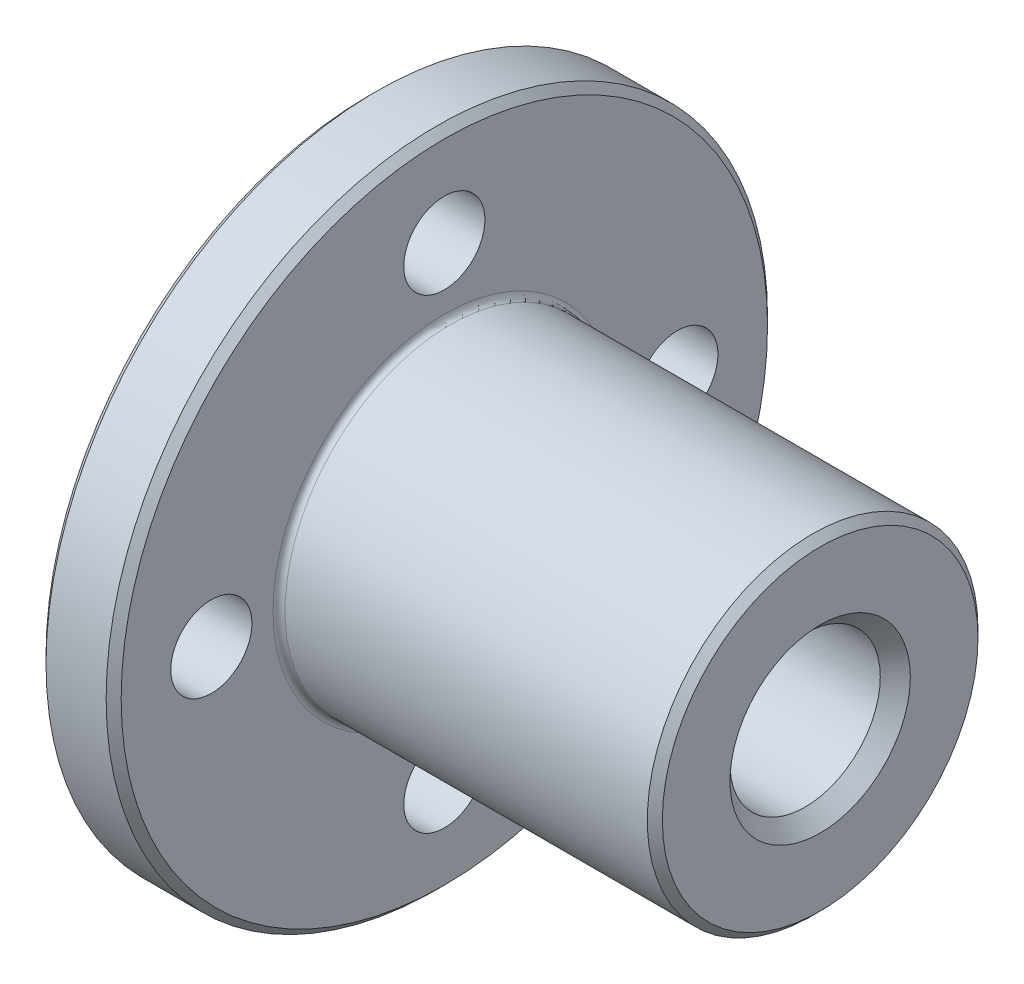
ISO-10303-21;
HEADER;
FILE_DESCRIPTION(('STEP AP214'),'2;1');
FILE_NAME('part.step','',(''),(''),'','','');
FILE_SCHEMA(('AUTOMOTIVE_DESIGN { 1 0 10303 214 1 1 1 1 }'));
ENDSEC;
DATA;
#1=APPLICATION_CONTEXT('core data for automotive mechanical design processes');
#2=APPLICATION_PROTOCOL_DEFINITION('international standard','automotive_design',2000,#1);
#3=PRODUCT_CONTEXT('',#1,'mechanical');
#4=PRODUCT('Part','Part','',(#3));
#5=PRODUCT_RELATED_PRODUCT_CATEGORY('part','',(#4));
#6=PRODUCT_DEFINITION_FORMATION('','',#4);
#7=PRODUCT_DEFINITION_CONTEXT('part definition',#1,'design');
#8=PRODUCT_DEFINITION('design','',#6,#7);
#9=PRODUCT_DEFINITION_SHAPE('','',#8);
#10=(LENGTH_UNIT() NAMED_UNIT(*) SI_UNIT(.MILLI.,.METRE.));
#11=(NAMED_UNIT(*) PLANE_ANGLE_UNIT() SI_UNIT($,.RADIAN.));
#12=(NAMED_UNIT(*) SI_UNIT($,.STERADIAN.) SOLID_ANGLE_UNIT());
#13=UNCERTAINTY_MEASURE_WITH_UNIT(LENGTH_MEASURE(1.E-05),#10,'distance_accuracy_value','');
#14=(GEOMETRIC_REPRESENTATION_CONTEXT(3) GLOBAL_UNCERTAINTY_ASSIGNED_CONTEXT((#13)) GLOBAL_UNIT_ASSIGNED_CONTEXT((#10,
#11,#12)) REPRESENTATION_CONTEXT('',''));
#15=CARTESIAN_POINT('',(0.,0.,0.));
#16=DIRECTION('',(0.,0.,1.));
#17=DIRECTION('',(1.,0.,0.));
#18=AXIS2_PLACEMENT_3D('',#15,#16,#17);
#19=CARTESIAN_POINT('',(5.,0.,0.));
#20=DIRECTION('',(-1.,0.,0.));
#21=DIRECTION('',(0.,0.,1.));
#22=AXIS2_PLACEMENT_3D('',#19,#20,#21);
#23=CYLINDRICAL_SURFACE('',#22,22.);
#24=CARTESIAN_POINT('',(0.500000000000025,0.,0.));
#25=DIRECTION('',(-1.,0.,0.));
#26=DIRECTION('',(0.,0.,1.));
#27=AXIS2_PLACEMENT_3D('',#24,#25,#26);
#28=CIRCLE('',#27,22.);
#29=CARTESIAN_POINT('',(0.500000000000025,0.,22.));
#30=VERTEX_POINT('',#29);
#31=EDGE_CURVE('E67',#30,#30,#28,.F.);
#32=ORIENTED_EDGE('',*,*,#31,.T.);
#33=EDGE_LOOP('',(#32));
#34=FACE_BOUND('',#33,.T.);
#35=CARTESIAN_POINT('',(4.49999999999999,0.,0.));
#36=DIRECTION('',(1.,0.,0.));
#37=DIRECTION('',(0.,0.,-1.));
#38=AXIS2_PLACEMENT_3D('',#35,#36,#37);
#39=CIRCLE('',#38,22.);
#40=CARTESIAN_POINT('',(4.49999999999999,0.,-22.));
#41=VERTEX_POINT('',#40);
#42=EDGE_CURVE('E70',#41,#41,#39,.F.);
#43=ORIENTED_EDGE('',*,*,#42,.T.);
#44=EDGE_LOOP('',(#43));
#45=FACE_BOUND('',#44,.T.);
#46=ADVANCED_FACE('F32',(#34,#45),#23,.T.);
#47=CARTESIAN_POINT('',(5.,22.,0.));
#48=DIRECTION('',(1.,0.,0.));
#49=DIRECTION('',(0.,0.,-1.));
#50=AXIS2_PLACEMENT_3D('',#47,#48,#49);
#51=PLANE('',#50);
#52=CARTESIAN_POINT('',(5.,0.,0.));
#53=DIRECTION('',(1.,0.,0.));
#54=DIRECTION('',(0.,0.,-1.));
#55=AXIS2_PLACEMENT_3D('',#52,#53,#54);
#56=CIRCLE('',#55,11.4);
#57=CARTESIAN_POINT('',(5.,0.,-11.4));
#58=VERTEX_POINT('',#57);
#59=EDGE_CURVE('E10',#58,#58,#56,.F.);
#60=ORIENTED_EDGE('',*,*,#59,.T.);
#61=EDGE_LOOP('',(#60));
#62=FACE_BOUND('',#61,.T.);
#63=CARTESIAN_POINT('',(5.,0.,0.));
#64=DIRECTION('',(1.,0.,0.));
#65=DIRECTION('',(0.,0.,-1.));
#66=AXIS2_PLACEMENT_3D('',#63,#64,#65);
#67=CIRCLE('',#66,21.5);
#68=CARTESIAN_POINT('',(5.,0.,-21.5));
#69=VERTEX_POINT('',#68);
#70=EDGE_CURVE('E58',#69,#69,#67,.T.);
#71=ORIENTED_EDGE('',*,*,#70,.T.);
#72=EDGE_LOOP('',(#71));
#73=FACE_BOUND('',#72,.T.);
#74=CARTESIAN_POINT('',(5.,-15.5,0.));
#75=DIRECTION('',(1.,0.,0.));
#76=DIRECTION('',(0.,0.,-1.));
#77=AXIS2_PLACEMENT_3D('',#74,#75,#76);
#78=CIRCLE('',#77,2.69999999999999);
#79=CARTESIAN_POINT('',(5.,-15.5,-2.69999999999999));
#80=VERTEX_POINT('',#79);
#81=EDGE_CURVE('E97',#80,#80,#78,.T.);
#82=ORIENTED_EDGE('',*,*,#81,.F.);
#83=EDGE_LOOP('',(#82));
#84=FACE_BOUND('',#83,.T.);
#85=CARTESIAN_POINT('',(5.,0.,-15.5));
#86=DIRECTION('',(1.,0.,0.));
#87=DIRECTION('',(0.,0.,-1.));
#88=AXIS2_PLACEMENT_3D('',#85,#86,#87);
#89=CIRCLE('',#88,2.69999999999999);
#90=CARTESIAN_POINT('',(5.,0.,-18.2));
#91=VERTEX_POINT('',#90);
#92=EDGE_CURVE('E91',#91,#91,#89,.T.);
#93=ORIENTED_EDGE('',*,*,#92,.F.);
#94=EDGE_LOOP('',(#93));
#95=FACE_BOUND('',#94,.T.);
#96=CARTESIAN_POINT('',(5.,0.,15.5));
#97=DIRECTION('',(1.,0.,0.));
#98=DIRECTION('',(0.,0.,-1.));
#99=AXIS2_PLACEMENT_3D('',#96,#97,#98);
#100=CIRCLE('',#99,2.69999999999999);
#101=CARTESIAN_POINT('',(5.,0.,12.8));
#102=VERTEX_POINT('',#101);
#103=EDGE_CURVE('E85',#102,#102,#100,.T.);
#104=ORIENTED_EDGE('',*,*,#103,.F.);
#105=EDGE_LOOP('',(#104));
#106=FACE_BOUND('',#105,.T.);
#107=CARTESIAN_POINT('',(5.,15.5,0.));
#108=DIRECTION('',(1.,0.,0.));
#109=DIRECTION('',(0.,0.,-1.));
#110=AXIS2_PLACEMENT_3D('',#107,#108,#109);
#111=CIRCLE('',#110,2.69999999999999);
#112=CARTESIAN_POINT('',(5.,15.5,-2.69999999999999));
#113=VERTEX_POINT('',#112);
#114=EDGE_CURVE('E79',#113,#113,#111,.T.);
#115=ORIENTED_EDGE('',*,*,#114,.F.);
#116=EDGE_LOOP('',(#115));
#117=FACE_BOUND('',#116,.T.);
#118=ADVANCED_FACE('F103',(#62,#73,#84,#95,#106,#117),#51,.T.);
#119=CARTESIAN_POINT('',(0.,0.,0.));
#120=DIRECTION('',(-1.,0.,0.));
#121=DIRECTION('',(0.,0.,1.));
#122=AXIS2_PLACEMENT_3D('',#119,#120,#121);
#123=PLANE('',#122);
#124=CARTESIAN_POINT('',(0.,0.,0.));
#125=DIRECTION('',(-1.,0.,0.));
#126=DIRECTION('',(0.,0.,1.));
#127=AXIS2_PLACEMENT_3D('',#124,#125,#126);
#128=CIRCLE('',#127,5.99999999999997);
#129=CARTESIAN_POINT('',(0.,0.,5.99999999999997));
#130=VERTEX_POINT('',#129);
#131=EDGE_CURVE('E55',#130,#130,#128,.F.);
#132=ORIENTED_EDGE('',*,*,#131,.T.);
#133=EDGE_LOOP('',(#132));
#134=FACE_BOUND('',#133,.T.);
#135=CARTESIAN_POINT('',(0.,0.,0.));
#136=DIRECTION('',(-1.,0.,0.));
#137=DIRECTION('',(0.,0.,1.));
#138=AXIS2_PLACEMENT_3D('',#135,#136,#137);
#139=CIRCLE('',#138,21.5);
#140=CARTESIAN_POINT('',(0.,0.,21.5));
#141=VERTEX_POINT('',#140);
#142=EDGE_CURVE('E73',#141,#141,#139,.T.);
#143=ORIENTED_EDGE('',*,*,#142,.T.);
#144=EDGE_LOOP('',(#143));
#145=FACE_BOUND('',#144,.T.);
#146=CARTESIAN_POINT('',(0.,-15.5,0.));
#147=DIRECTION('',(1.,0.,0.));
#148=DIRECTION('',(0.,0.,-1.));
#149=AXIS2_PLACEMENT_3D('',#146,#147,#148);
#150=CIRCLE('',#149,2.69999999999999);
#151=CARTESIAN_POINT('',(0.,-15.5,-2.69999999999999));
#152=VERTEX_POINT('',#151);
#153=EDGE_CURVE('E94',#152,#152,#150,.T.);
#154=ORIENTED_EDGE('',*,*,#153,.T.);
#155=EDGE_LOOP('',(#154));
#156=FACE_BOUND('',#155,.T.);
#157=CARTESIAN_POINT('',(0.,0.,-15.5));
#158=DIRECTION('',(1.,0.,0.));
#159=DIRECTION('',(0.,0.,-1.));
#160=AXIS2_PLACEMENT_3D('',#157,#158,#159);
#161=CIRCLE('',#160,2.69999999999999);
#162=CARTESIAN_POINT('',(0.,0.,-18.2));
#163=VERTEX_POINT('',#162);
#164=EDGE_CURVE('E88',#163,#163,#161,.T.);
#165=ORIENTED_EDGE('',*,*,#164,.T.);
#166=EDGE_LOOP('',(#165));
#167=FACE_BOUND('',#166,.T.);
#168=CARTESIAN_POINT('',(0.,0.,15.5));
#169=DIRECTION('',(1.,0.,0.));
#170=DIRECTION('',(0.,0.,-1.));
#171=AXIS2_PLACEMENT_3D('',#168,#169,#170);
#172=CIRCLE('',#171,2.69999999999999);
#173=CARTESIAN_POINT('',(0.,0.,12.8));
#174=VERTEX_POINT('',#173);
#175=EDGE_CURVE('E82',#174,#174,#172,.T.);
#176=ORIENTED_EDGE('',*,*,#175,.T.);
#177=EDGE_LOOP('',(#176));
#178=FACE_BOUND('',#177,.T.);
#179=CARTESIAN_POINT('',(0.,15.5,0.));
#180=DIRECTION('',(1.,0.,0.));
#181=DIRECTION('',(0.,0.,-1.));
#182=AXIS2_PLACEMENT_3D('',#179,#180,#181);
#183=CIRCLE('',#182,2.69999999999999);
#184=CARTESIAN_POINT('',(0.,15.5,-2.69999999999999));
#185=VERTEX_POINT('',#184);
#186=EDGE_CURVE('E76',#185,#185,#183,.T.);
#187=ORIENTED_EDGE('',*,*,#186,.T.);
#188=EDGE_LOOP('',(#187));
#189=FACE_BOUND('',#188,.T.);
#190=ADVANCED_FACE('F106',(#134,#145,#156,#167,#178,#189),#123,.T.);
#191=CARTESIAN_POINT('',(30.,0.,0.));
#192=DIRECTION('',(-1.,0.,0.));
#193=DIRECTION('',(0.,0.,1.));
#194=AXIS2_PLACEMENT_3D('',#191,#192,#193);
#195=CYLINDRICAL_SURFACE('',#194,11.);
#196=CARTESIAN_POINT('',(5.4,0.,0.));
#197=DIRECTION('',(1.,0.,0.));
#198=DIRECTION('',(0.,0.,-1.));
#199=AXIS2_PLACEMENT_3D('',#196,#197,#198);
#200=CIRCLE('',#199,11.);
#201=CARTESIAN_POINT('',(5.4,0.,-11.));
#202=VERTEX_POINT('',#201);
#203=EDGE_CURVE('E39',#202,#202,#200,.T.);
#204=ORIENTED_EDGE('',*,*,#203,.T.);
#205=EDGE_LOOP('',(#204));
#206=FACE_BOUND('',#205,.T.);
#207=CARTESIAN_POINT('',(29.5,0.,0.));
#208=DIRECTION('',(1.,0.,0.));
#209=DIRECTION('',(0.,0.,-1.));
#210=AXIS2_PLACEMENT_3D('',#207,#208,#209);
#211=CIRCLE('',#210,11.);
#212=CARTESIAN_POINT('',(29.5,0.,-11.));
#213=VERTEX_POINT('',#212);
#214=EDGE_CURVE('E61',#213,#213,#211,.F.);
#215=ORIENTED_EDGE('',*,*,#214,.T.);
#216=EDGE_LOOP('',(#215));
#217=FACE_BOUND('',#216,.T.);
#218=ADVANCED_FACE('F127',(#206,#217),#195,.T.);
#219=CARTESIAN_POINT('',(30.,0.,0.));
#220=DIRECTION('',(1.,0.,0.));
#221=DIRECTION('',(0.,0.,-1.));
#222=AXIS2_PLACEMENT_3D('',#219,#220,#221);
#223=PLANE('',#222);
#224=CARTESIAN_POINT('',(30.,0.,0.));
#225=DIRECTION('',(1.,0.,0.));
#226=DIRECTION('',(0.,0.,-1.));
#227=AXIS2_PLACEMENT_3D('',#224,#225,#226);
#228=CIRCLE('',#227,5.99999999999995);
#229=CARTESIAN_POINT('',(30.,0.,-5.99999999999995));
#230=VERTEX_POINT('',#229);
#231=EDGE_CURVE('E43',#230,#230,#228,.F.);
#232=ORIENTED_EDGE('',*,*,#231,.T.);
#233=EDGE_LOOP('',(#232));
#234=FACE_BOUND('',#233,.T.);
#235=CARTESIAN_POINT('',(30.,0.,0.));
#236=DIRECTION('',(1.,0.,0.));
#237=DIRECTION('',(0.,0.,-1.));
#238=AXIS2_PLACEMENT_3D('',#235,#236,#237);
#239=CIRCLE('',#238,10.5);
#240=CARTESIAN_POINT('',(30.,0.,-10.5));
#241=VERTEX_POINT('',#240);
#242=EDGE_CURVE('E64',#241,#241,#239,.T.);
#243=ORIENTED_EDGE('',*,*,#242,.T.);
#244=EDGE_LOOP('',(#243));
#245=FACE_BOUND('',#244,.T.);
#246=ADVANCED_FACE('F117',(#234,#245),#223,.T.);
#247=CARTESIAN_POINT('',(5.,15.5,0.));
#248=DIRECTION('',(1.,0.,0.));
#249=DIRECTION('',(0.,0.,-1.));
#250=AXIS2_PLACEMENT_3D('',#247,#248,#249);
#251=CYLINDRICAL_SURFACE('',#250,2.69999999999999);
#252=ORIENTED_EDGE('',*,*,#186,.F.);
#253=EDGE_LOOP('',(#252));
#254=FACE_BOUND('',#253,.T.);
#255=ORIENTED_EDGE('',*,*,#114,.T.);
#256=EDGE_LOOP('',(#255));
#257=FACE_BOUND('',#256,.T.);
#258=ADVANCED_FACE('F114',(#254,#257),#251,.F.);
#259=CARTESIAN_POINT('',(5.,0.,15.5));
#260=DIRECTION('',(1.,0.,0.));
#261=DIRECTION('',(0.,0.,-1.));
#262=AXIS2_PLACEMENT_3D('',#259,#260,#261);
#263=CYLINDRICAL_SURFACE('',#262,2.69999999999999);
#264=ORIENTED_EDGE('',*,*,#175,.F.);
#265=EDGE_LOOP('',(#264));
#266=FACE_BOUND('',#265,.T.);
#267=ORIENTED_EDGE('',*,*,#103,.T.);
#268=EDGE_LOOP('',(#267));
#269=FACE_BOUND('',#268,.T.);
#270=ADVANCED_FACE('F116',(#266,#269),#263,.F.);
#271=CARTESIAN_POINT('',(5.,0.,-15.5));
#272=DIRECTION('',(1.,0.,0.));
#273=DIRECTION('',(0.,0.,-1.));
#274=AXIS2_PLACEMENT_3D('',#271,#272,#273);
#275=CYLINDRICAL_SURFACE('',#274,2.69999999999999);
#276=ORIENTED_EDGE('',*,*,#164,.F.);
#277=EDGE_LOOP('',(#276));
#278=FACE_BOUND('',#277,.T.);
#279=ORIENTED_EDGE('',*,*,#92,.T.);
#280=EDGE_LOOP('',(#279));
#281=FACE_BOUND('',#280,.T.);
#282=ADVANCED_FACE('F124',(#278,#281),#275,.F.);
#283=CARTESIAN_POINT('',(5.,-15.5,0.));
#284=DIRECTION('',(1.,0.,0.));
#285=DIRECTION('',(0.,0.,-1.));
#286=AXIS2_PLACEMENT_3D('',#283,#284,#285);
#287=CYLINDRICAL_SURFACE('',#286,2.69999999999999);
#288=ORIENTED_EDGE('',*,*,#153,.F.);
#289=EDGE_LOOP('',(#288));
#290=FACE_BOUND('',#289,.T.);
#291=ORIENTED_EDGE('',*,*,#81,.T.);
#292=EDGE_LOOP('',(#291));
#293=FACE_BOUND('',#292,.T.);
#294=ADVANCED_FACE('F101',(#290,#293),#287,.F.);
#295=CARTESIAN_POINT('',(30.,0.,0.));
#296=DIRECTION('',(1.,0.,0.));
#297=DIRECTION('',(0.,0.,-1.));
#298=AXIS2_PLACEMENT_3D('',#295,#296,#297);
#299=CYLINDRICAL_SURFACE('',#298,4.99999999999999);
#300=CARTESIAN_POINT('',(0.99999999999999,0.,0.));
#301=DIRECTION('',(-1.,0.,0.));
#302=DIRECTION('',(0.,0.,1.));
#303=AXIS2_PLACEMENT_3D('',#300,#301,#302);
#304=CIRCLE('',#303,4.99999999999999);
#305=CARTESIAN_POINT('',(0.99999999999999,0.,4.99999999999999));
#306=VERTEX_POINT('',#305);
#307=EDGE_CURVE('E47',#306,#306,#304,.T.);
#308=ORIENTED_EDGE('',*,*,#307,.T.);
#309=EDGE_LOOP('',(#308));
#310=FACE_BOUND('',#309,.T.);
#311=CARTESIAN_POINT('',(29.,0.,0.));
#312=DIRECTION('',(1.,0.,0.));
#313=DIRECTION('',(0.,0.,-1.));
#314=AXIS2_PLACEMENT_3D('',#311,#312,#313);
#315=CIRCLE('',#314,4.99999999999999);
#316=CARTESIAN_POINT('',(29.,0.,-4.99999999999999));
#317=VERTEX_POINT('',#316);
#318=EDGE_CURVE('E52',#317,#317,#315,.T.);
#319=ORIENTED_EDGE('',*,*,#318,.T.);
#320=EDGE_LOOP('',(#319));
#321=FACE_BOUND('',#320,.T.);
#322=ADVANCED_FACE('F143',(#310,#321),#299,.F.);
#323=CARTESIAN_POINT('',(0.,0.,0.));
#324=DIRECTION('',(1.,0.,0.));
#325=DIRECTION('',(0.,0.,-1.));
#326=AXIS2_PLACEMENT_3D('',#323,#324,#325);
#327=CONICAL_SURFACE('',#326,21.5,0.785398163397445);
#328=ORIENTED_EDGE('',*,*,#31,.F.);
#329=EDGE_LOOP('',(#328));
#330=FACE_BOUND('',#329,.T.);
#331=ORIENTED_EDGE('',*,*,#142,.F.);
#332=EDGE_LOOP('',(#331));
#333=FACE_BOUND('',#332,.T.);
#334=ADVANCED_FACE('F139',(#330,#333),#327,.T.);
#335=CARTESIAN_POINT('',(30.,0.,0.));
#336=DIRECTION('',(-1.,0.,0.));
#337=DIRECTION('',(0.,0.,1.));
#338=AXIS2_PLACEMENT_3D('',#335,#336,#337);
#339=CONICAL_SURFACE('',#338,10.5,0.785398163397443);
#340=ORIENTED_EDGE('',*,*,#214,.F.);
#341=EDGE_LOOP('',(#340));
#342=FACE_BOUND('',#341,.T.);
#343=ORIENTED_EDGE('',*,*,#242,.F.);
#344=EDGE_LOOP('',(#343));
#345=FACE_BOUND('',#344,.T.);
#346=ADVANCED_FACE('F142',(#342,#345),#339,.T.);
#347=CARTESIAN_POINT('',(4.49999999999999,0.,0.));
#348=DIRECTION('',(-1.,0.,0.));
#349=DIRECTION('',(0.,0.,1.));
#350=AXIS2_PLACEMENT_3D('',#347,#348,#349);
#351=CONICAL_SURFACE('',#350,22.,0.785398163397455);
#352=ORIENTED_EDGE('',*,*,#70,.F.);
#353=EDGE_LOOP('',(#352));
#354=FACE_BOUND('',#353,.T.);
#355=ORIENTED_EDGE('',*,*,#42,.F.);
#356=EDGE_LOOP('',(#355));
#357=FACE_BOUND('',#356,.T.);
#358=ADVANCED_FACE('F147',(#354,#357),#351,.T.);
#359=CARTESIAN_POINT('',(0.,0.,0.));
#360=DIRECTION('',(-1.,0.,0.));
#361=DIRECTION('',(0.,0.,1.));
#362=AXIS2_PLACEMENT_3D('',#359,#360,#361);
#363=CONICAL_SURFACE('',#362,5.99999999999997,0.785398163397445);
#364=ORIENTED_EDGE('',*,*,#307,.F.);
#365=EDGE_LOOP('',(#364));
#366=FACE_BOUND('',#365,.T.);
#367=ORIENTED_EDGE('',*,*,#131,.F.);
#368=EDGE_LOOP('',(#367));
#369=FACE_BOUND('',#368,.T.);
#370=ADVANCED_FACE('F151',(#366,#369),#363,.F.);
#371=CARTESIAN_POINT('',(29.,0.,0.));
#372=DIRECTION('',(1.,0.,0.));
#373=DIRECTION('',(0.,0.,-1.));
#374=AXIS2_PLACEMENT_3D('',#371,#372,#373);
#375=CONICAL_SURFACE('',#374,4.99999999999999,0.78539816339745);
#376=ORIENTED_EDGE('',*,*,#231,.F.);
#377=EDGE_LOOP('',(#376));
#378=FACE_BOUND('',#377,.T.);
#379=ORIENTED_EDGE('',*,*,#318,.F.);
#380=EDGE_LOOP('',(#379));
#381=FACE_BOUND('',#380,.T.);
#382=ADVANCED_FACE('F154',(#378,#381),#375,.F.);
#383=CARTESIAN_POINT('',(5.4,0.,0.));
#384=DIRECTION('',(1.,0.,0.));
#385=DIRECTION('',(0.,0.,-1.));
#386=AXIS2_PLACEMENT_3D('',#383,#384,#385);
#387=TOROIDAL_SURFACE('',#386,11.4,0.4);
#388=ORIENTED_EDGE('',*,*,#59,.F.);
#389=EDGE_LOOP('',(#388));
#390=FACE_BOUND('',#389,.T.);
#391=ORIENTED_EDGE('',*,*,#203,.F.);
#392=EDGE_LOOP('',(#391));
#393=FACE_BOUND('',#392,.T.);
#394=ADVANCED_FACE('F34',(#390,#393),#387,.F.);
#395=CLOSED_SHELL('',(#46,#118,#190,#218,#246,#258,#270,#282,#294,#322,#334,#346,#358,#370,#382,#394));
#396=MANIFOLD_SOLID_BREP('B2',#395);
#397=ADVANCED_BREP_SHAPE_REPRESENTATION('',(#18,#396),#14);
#398=SHAPE_DEFINITION_REPRESENTATION(#9,#397);
ENDSEC;
END-ISO-10303-21;
